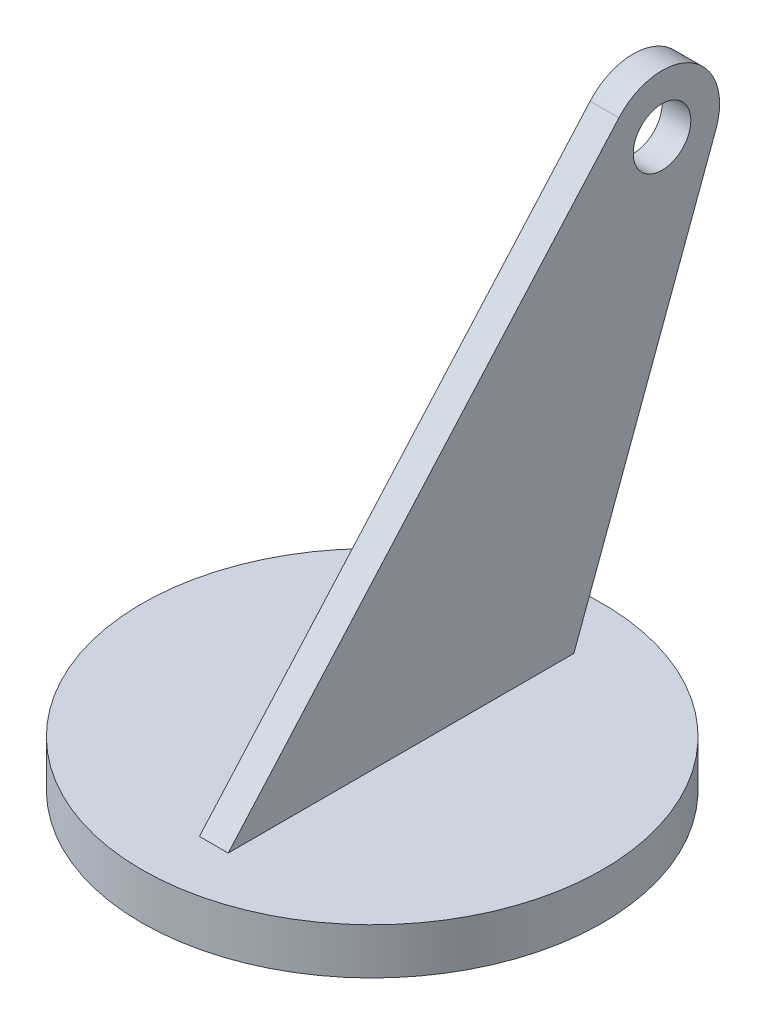
ISO-10303-21;
HEADER;
FILE_DESCRIPTION(('STEP AP214'),'2;1');
FILE_NAME('part.step','',(''),(''),'','','');
FILE_SCHEMA(('AUTOMOTIVE_DESIGN { 1 0 10303 214 1 1 1 1 }'));
ENDSEC;
DATA;
#1=APPLICATION_CONTEXT('core data for automotive mechanical design processes');
#2=APPLICATION_PROTOCOL_DEFINITION('international standard','automotive_design',2000,#1);
#3=PRODUCT_CONTEXT('',#1,'mechanical');
#4=PRODUCT('Part','Part','',(#3));
#5=PRODUCT_RELATED_PRODUCT_CATEGORY('part','',(#4));
#6=PRODUCT_DEFINITION_FORMATION('','',#4);
#7=PRODUCT_DEFINITION_CONTEXT('part definition',#1,'design');
#8=PRODUCT_DEFINITION('design','',#6,#7);
#9=PRODUCT_DEFINITION_SHAPE('','',#8);
#10=(LENGTH_UNIT() NAMED_UNIT(*) SI_UNIT(.MILLI.,.METRE.));
#11=(NAMED_UNIT(*) PLANE_ANGLE_UNIT() SI_UNIT($,.RADIAN.));
#12=(NAMED_UNIT(*) SI_UNIT($,.STERADIAN.) SOLID_ANGLE_UNIT());
#13=UNCERTAINTY_MEASURE_WITH_UNIT(LENGTH_MEASURE(1.E-05),#10,'distance_accuracy_value','');
#14=(GEOMETRIC_REPRESENTATION_CONTEXT(3) GLOBAL_UNCERTAINTY_ASSIGNED_CONTEXT((#13)) GLOBAL_UNIT_ASSIGNED_CONTEXT((#10,
#11,#12)) REPRESENTATION_CONTEXT('',''));
#15=CARTESIAN_POINT('',(0.,0.,0.));
#16=DIRECTION('',(0.,0.,1.));
#17=DIRECTION('',(1.,0.,0.));
#18=AXIS2_PLACEMENT_3D('',#15,#16,#17);
#19=CARTESIAN_POINT('',(0.,4.,0.));
#20=DIRECTION('',(0.,1.,0.));
#21=DIRECTION('',(0.,0.,1.));
#22=AXIS2_PLACEMENT_3D('',#19,#20,#21);
#23=PLANE('',#22);
#24=CARTESIAN_POINT('',(0.,4.,0.));
#25=DIRECTION('',(0.,1.,0.));
#26=DIRECTION('',(0.,0.,1.));
#27=AXIS2_PLACEMENT_3D('',#24,#25,#26);
#28=CIRCLE('',#27,40.);
#29=CARTESIAN_POINT('',(0.,4.,40.));
#30=VERTEX_POINT('',#29);
#31=EDGE_CURVE('E11',#30,#30,#28,.T.);
#32=ORIENTED_EDGE('',*,*,#31,.T.);
#33=EDGE_LOOP('',(#32));
#34=FACE_BOUND('',#33,.T.);
#35=DIRECTION('',(0.,0.,-1.));
#36=VECTOR('',#35,1.);
#37=CARTESIAN_POINT('',(0.,4.00000000000001,0.));
#38=LINE('',#37,#36);
#39=CARTESIAN_POINT('',(0.,4.,30.));
#40=VERTEX_POINT('',#39);
#41=CARTESIAN_POINT('',(0.,4.00000000000002,-30.));
#42=VERTEX_POINT('',#41);
#43=EDGE_CURVE('E48',#40,#42,#38,.T.);
#44=ORIENTED_EDGE('',*,*,#43,.T.);
#45=DIRECTION('',(-1.,0.,0.));
#46=VECTOR('',#45,1.);
#47=CARTESIAN_POINT('',(5.,4.00000000000002,-30.));
#48=LINE('',#47,#46);
#49=CARTESIAN_POINT('',(5.,4.00000000000002,-30.));
#50=VERTEX_POINT('',#49);
#51=EDGE_CURVE('E94',#50,#42,#48,.T.);
#52=ORIENTED_EDGE('',*,*,#51,.F.);
#53=DIRECTION('',(0.,0.,-1.));
#54=VECTOR('',#53,1.);
#55=CARTESIAN_POINT('',(5.,4.00000000000001,0.));
#56=LINE('',#55,#54);
#57=CARTESIAN_POINT('',(5.,4.,30.));
#58=VERTEX_POINT('',#57);
#59=EDGE_CURVE('E88',#58,#50,#56,.T.);
#60=ORIENTED_EDGE('',*,*,#59,.F.);
#61=DIRECTION('',(-1.,0.,0.));
#62=VECTOR('',#61,1.);
#63=CARTESIAN_POINT('',(5.,4.,30.));
#64=LINE('',#63,#62);
#65=EDGE_CURVE('E99',#58,#40,#64,.T.);
#66=ORIENTED_EDGE('',*,*,#65,.T.);
#67=EDGE_LOOP('',(#44,#52,#60,#66));
#68=FACE_BOUND('',#67,.T.);
#69=ADVANCED_FACE('F33',(#34,#68),#23,.T.);
#70=CARTESIAN_POINT('',(0.,4.,0.));
#71=DIRECTION('',(0.,-1.,0.));
#72=DIRECTION('',(0.,0.,-1.));
#73=AXIS2_PLACEMENT_3D('',#70,#71,#72);
#74=CYLINDRICAL_SURFACE('',#73,40.);
#75=ORIENTED_EDGE('',*,*,#31,.F.);
#76=EDGE_LOOP('',(#75));
#77=FACE_BOUND('',#76,.T.);
#78=CARTESIAN_POINT('',(0.,-4.,0.));
#79=DIRECTION('',(0.,1.,0.));
#80=DIRECTION('',(0.,0.,1.));
#81=AXIS2_PLACEMENT_3D('',#78,#79,#80);
#82=CIRCLE('',#81,40.);
#83=CARTESIAN_POINT('',(0.,-4.,40.));
#84=VERTEX_POINT('',#83);
#85=EDGE_CURVE('E37',#84,#84,#82,.T.);
#86=ORIENTED_EDGE('',*,*,#85,.T.);
#87=EDGE_LOOP('',(#86));
#88=FACE_BOUND('',#87,.T.);
#89=ADVANCED_FACE('F35',(#77,#88),#74,.T.);
#90=CARTESIAN_POINT('',(0.,-4.,0.));
#91=DIRECTION('',(0.,1.,0.));
#92=DIRECTION('',(0.,0.,1.));
#93=AXIS2_PLACEMENT_3D('',#90,#91,#92);
#94=PLANE('',#93);
#95=ORIENTED_EDGE('',*,*,#85,.F.);
#96=EDGE_LOOP('',(#95));
#97=FACE_BOUND('',#96,.T.);
#98=ADVANCED_FACE('F116',(#97),#94,.F.);
#99=CARTESIAN_POINT('',(5.,74.,-45.3126944874741));
#100=DIRECTION('',(1.,0.,0.));
#101=DIRECTION('',(0.,0.,-1.));
#102=AXIS2_PLACEMENT_3D('',#99,#100,#101);
#103=PLANE('',#102);
#104=ORIENTED_EDGE('',*,*,#59,.T.);
#105=DIRECTION('',(0.,0.937516271769093,-0.347941432094799));
#106=VECTOR('',#105,1.);
#107=CARTESIAN_POINT('',(5.,4.00000000000002,-30.));
#108=LINE('',#107,#106);
#109=CARTESIAN_POINT('',(5.,70.520585679052,-54.6878572051651));
#110=VERTEX_POINT('',#109);
#111=EDGE_CURVE('E82',#50,#110,#108,.T.);
#112=ORIENTED_EDGE('',*,*,#111,.T.);
#113=CARTESIAN_POINT('',(5.,74.,-45.3126944874741));
#114=DIRECTION('',(1.,0.,0.));
#115=DIRECTION('',(0.,0.,-1.));
#116=AXIS2_PLACEMENT_3D('',#113,#114,#115);
#117=CIRCLE('',#116,10.);
#118=CARTESIAN_POINT('',(5.,80.6278448804247,-37.8245924421606));
#119=VERTEX_POINT('',#118);
#120=EDGE_CURVE('E86',#110,#119,#117,.T.);
#121=ORIENTED_EDGE('',*,*,#120,.T.);
#122=DIRECTION('',(0.,-0.748810204531352,0.662784488042467));
#123=VECTOR('',#122,1.);
#124=CARTESIAN_POINT('',(5.,4.,30.));
#125=LINE('',#124,#123);
#126=EDGE_CURVE('E57',#119,#58,#125,.T.);
#127=ORIENTED_EDGE('',*,*,#126,.T.);
#128=EDGE_LOOP('',(#104,#112,#121,#127));
#129=FACE_BOUND('',#128,.T.);
#130=CARTESIAN_POINT('',(5.,74.,-45.3126944874741));
#131=DIRECTION('',(1.,0.,0.));
#132=DIRECTION('',(0.,0.,-1.));
#133=AXIS2_PLACEMENT_3D('',#130,#131,#132);
#134=CIRCLE('',#133,5.);
#135=CARTESIAN_POINT('',(5.,74.,-50.3126944874741));
#136=VERTEX_POINT('',#135);
#137=EDGE_CURVE('E104',#136,#136,#134,.T.);
#138=ORIENTED_EDGE('',*,*,#137,.F.);
#139=EDGE_LOOP('',(#138));
#140=FACE_BOUND('',#139,.T.);
#141=ADVANCED_FACE('F83',(#129,#140),#103,.T.);
#142=CARTESIAN_POINT('',(0.,74.,-45.3126944874741));
#143=DIRECTION('',(1.,0.,0.));
#144=DIRECTION('',(0.,0.,-1.));
#145=AXIS2_PLACEMENT_3D('',#142,#143,#144);
#146=PLANE('',#145);
#147=DIRECTION('',(0.,0.937516271769093,-0.347941432094799));
#148=VECTOR('',#147,1.);
#149=CARTESIAN_POINT('',(0.,4.00000000000002,-30.));
#150=LINE('',#149,#148);
#151=CARTESIAN_POINT('',(0.,70.520585679052,-54.6878572051651));
#152=VERTEX_POINT('',#151);
#153=EDGE_CURVE('E93',#42,#152,#150,.T.);
#154=ORIENTED_EDGE('',*,*,#153,.F.);
#155=ORIENTED_EDGE('',*,*,#43,.F.);
#156=DIRECTION('',(0.,-0.748810204531352,0.662784488042467));
#157=VECTOR('',#156,1.);
#158=CARTESIAN_POINT('',(0.,4.,30.));
#159=LINE('',#158,#157);
#160=CARTESIAN_POINT('',(0.,80.6278448804247,-37.8245924421606));
#161=VERTEX_POINT('',#160);
#162=EDGE_CURVE('E106',#161,#40,#159,.T.);
#163=ORIENTED_EDGE('',*,*,#162,.F.);
#164=CARTESIAN_POINT('',(0.,74.,-45.3126944874741));
#165=DIRECTION('',(1.,0.,0.));
#166=DIRECTION('',(0.,0.,-1.));
#167=AXIS2_PLACEMENT_3D('',#164,#165,#166);
#168=CIRCLE('',#167,10.);
#169=EDGE_CURVE('E74',#152,#161,#168,.T.);
#170=ORIENTED_EDGE('',*,*,#169,.F.);
#171=EDGE_LOOP('',(#154,#155,#163,#170));
#172=FACE_BOUND('',#171,.T.);
#173=CARTESIAN_POINT('',(0.,74.,-45.3126944874741));
#174=DIRECTION('',(1.,0.,0.));
#175=DIRECTION('',(0.,0.,-1.));
#176=AXIS2_PLACEMENT_3D('',#173,#174,#175);
#177=CIRCLE('',#176,5.);
#178=CARTESIAN_POINT('',(0.,74.,-50.3126944874741));
#179=VERTEX_POINT('',#178);
#180=EDGE_CURVE('E152',#179,#179,#177,.T.);
#181=ORIENTED_EDGE('',*,*,#180,.T.);
#182=EDGE_LOOP('',(#181));
#183=FACE_BOUND('',#182,.T.);
#184=ADVANCED_FACE('F122',(#172,#183),#146,.F.);
#185=CARTESIAN_POINT('',(5.,4.00000000000002,-30.));
#186=DIRECTION('',(0.,0.347941432094799,0.937516271769093));
#187=DIRECTION('',(0.,-0.937516271769093,0.347941432094799));
#188=AXIS2_PLACEMENT_3D('',#185,#186,#187);
#189=PLANE('',#188);
#190=ORIENTED_EDGE('',*,*,#153,.T.);
#191=DIRECTION('',(-1.,0.,0.));
#192=VECTOR('',#191,1.);
#193=CARTESIAN_POINT('',(5.,70.520585679052,-54.6878572051651));
#194=LINE('',#193,#192);
#195=EDGE_CURVE('E91',#110,#152,#194,.T.);
#196=ORIENTED_EDGE('',*,*,#195,.F.);
#197=ORIENTED_EDGE('',*,*,#111,.F.);
#198=ORIENTED_EDGE('',*,*,#51,.T.);
#199=EDGE_LOOP('',(#190,#196,#197,#198));
#200=FACE_BOUND('',#199,.T.);
#201=ADVANCED_FACE('F92',(#200),#189,.F.);
#202=CARTESIAN_POINT('',(5.,74.,-45.3126944874741));
#203=DIRECTION('',(-1.,0.,0.));
#204=DIRECTION('',(0.,0.,1.));
#205=AXIS2_PLACEMENT_3D('',#202,#203,#204);
#206=CYLINDRICAL_SURFACE('',#205,10.);
#207=ORIENTED_EDGE('',*,*,#169,.T.);
#208=DIRECTION('',(-1.,0.,0.));
#209=VECTOR('',#208,1.);
#210=CARTESIAN_POINT('',(5.,80.6278448804247,-37.8245924421606));
#211=LINE('',#210,#209);
#212=EDGE_CURVE('E95',#119,#161,#211,.T.);
#213=ORIENTED_EDGE('',*,*,#212,.F.);
#214=ORIENTED_EDGE('',*,*,#120,.F.);
#215=ORIENTED_EDGE('',*,*,#195,.T.);
#216=EDGE_LOOP('',(#207,#213,#214,#215));
#217=FACE_BOUND('',#216,.T.);
#218=ADVANCED_FACE('F97',(#217),#206,.T.);
#219=CARTESIAN_POINT('',(5.,4.,30.));
#220=DIRECTION('',(0.,-0.662784488042467,-0.748810204531352));
#221=DIRECTION('',(0.,0.748810204531352,-0.662784488042467));
#222=AXIS2_PLACEMENT_3D('',#219,#220,#221);
#223=PLANE('',#222);
#224=ORIENTED_EDGE('',*,*,#162,.T.);
#225=ORIENTED_EDGE('',*,*,#65,.F.);
#226=ORIENTED_EDGE('',*,*,#126,.F.);
#227=ORIENTED_EDGE('',*,*,#212,.T.);
#228=EDGE_LOOP('',(#224,#225,#226,#227));
#229=FACE_BOUND('',#228,.T.);
#230=ADVANCED_FACE('F136',(#229),#223,.F.);
#231=CARTESIAN_POINT('',(5.,74.,-45.3126944874741));
#232=DIRECTION('',(-1.,0.,0.));
#233=DIRECTION('',(0.,0.,1.));
#234=AXIS2_PLACEMENT_3D('',#231,#232,#233);
#235=CYLINDRICAL_SURFACE('',#234,5.);
#236=ORIENTED_EDGE('',*,*,#137,.T.);
#237=EDGE_LOOP('',(#236));
#238=FACE_BOUND('',#237,.T.);
#239=ORIENTED_EDGE('',*,*,#180,.F.);
#240=EDGE_LOOP('',(#239));
#241=FACE_BOUND('',#240,.T.);
#242=ADVANCED_FACE('F139',(#238,#241),#235,.F.);
#243=CLOSED_SHELL('',(#69,#89,#98,#141,#184,#201,#218,#230,#242));
#244=MANIFOLD_SOLID_BREP('B2',#243);
#245=ADVANCED_BREP_SHAPE_REPRESENTATION('',(#18,#244),#14);
#246=SHAPE_DEFINITION_REPRESENTATION(#9,#245);
ENDSEC;
END-ISO-10303-21;
